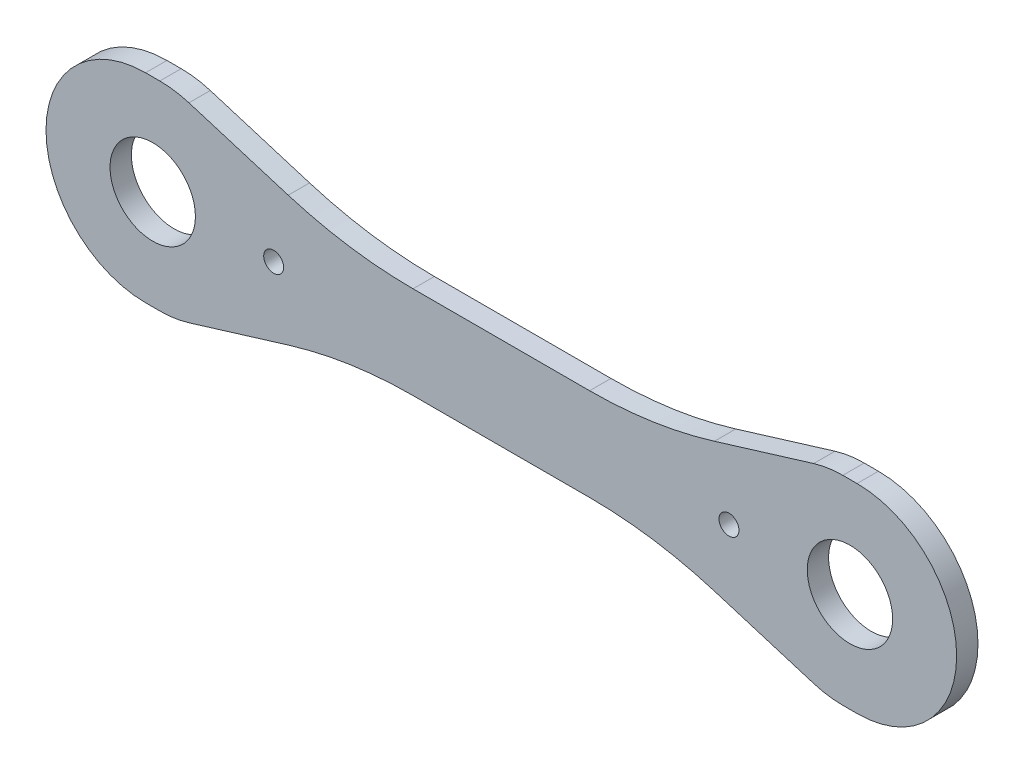
ISO-10303-21;
HEADER;
FILE_DESCRIPTION(('STEP AP214'),'2;1');
FILE_NAME('part.step','',(''),(''),'','','');
FILE_SCHEMA(('AUTOMOTIVE_DESIGN { 1 0 10303 214 1 1 1 1 }'));
ENDSEC;
DATA;
#1=APPLICATION_CONTEXT('core data for automotive mechanical design processes');
#2=APPLICATION_PROTOCOL_DEFINITION('international standard','automotive_design',2000,#1);
#3=PRODUCT_CONTEXT('',#1,'mechanical');
#4=PRODUCT('Part','Part','',(#3));
#5=PRODUCT_RELATED_PRODUCT_CATEGORY('part','',(#4));
#6=PRODUCT_DEFINITION_FORMATION('','',#4);
#7=PRODUCT_DEFINITION_CONTEXT('part definition',#1,'design');
#8=PRODUCT_DEFINITION('design','',#6,#7);
#9=PRODUCT_DEFINITION_SHAPE('','',#8);
#10=(LENGTH_UNIT() NAMED_UNIT(*) SI_UNIT(.MILLI.,.METRE.));
#11=(NAMED_UNIT(*) PLANE_ANGLE_UNIT() SI_UNIT($,.RADIAN.));
#12=(NAMED_UNIT(*) SI_UNIT($,.STERADIAN.) SOLID_ANGLE_UNIT());
#13=UNCERTAINTY_MEASURE_WITH_UNIT(LENGTH_MEASURE(1.E-05),#10,'distance_accuracy_value','');
#14=(GEOMETRIC_REPRESENTATION_CONTEXT(3) GLOBAL_UNCERTAINTY_ASSIGNED_CONTEXT((#13)) GLOBAL_UNIT_ASSIGNED_CONTEXT((#10,
#11,#12)) REPRESENTATION_CONTEXT('',''));
#15=CARTESIAN_POINT('',(0.,0.,0.));
#16=DIRECTION('',(0.,0.,1.));
#17=DIRECTION('',(1.,0.,0.));
#18=AXIS2_PLACEMENT_3D('',#15,#16,#17);
#19=CARTESIAN_POINT('',(-250.,0.,15.));
#20=DIRECTION('',(0.,0.,-1.));
#21=DIRECTION('',(-1.,0.,0.));
#22=AXIS2_PLACEMENT_3D('',#19,#20,#21);
#23=CYLINDRICAL_SURFACE('',#22,70.);
#24=CARTESIAN_POINT('',(-250.,0.,0.));
#25=DIRECTION('',(0.,0.,1.));
#26=DIRECTION('',(1.,0.,0.));
#27=AXIS2_PLACEMENT_3D('',#24,#25,#26);
#28=CIRCLE('',#27,70.);
#29=CARTESIAN_POINT('',(-250.,70.,0.));
#30=VERTEX_POINT('',#29);
#31=CARTESIAN_POINT('',(-250.,-70.,0.));
#32=VERTEX_POINT('',#31);
#33=EDGE_CURVE('E215',#30,#32,#28,.T.);
#34=ORIENTED_EDGE('',*,*,#33,.T.);
#35=DIRECTION('',(0.,0.,-1.));
#36=VECTOR('',#35,1.);
#37=CARTESIAN_POINT('',(-250.,-70.,15.));
#38=LINE('',#37,#36);
#39=CARTESIAN_POINT('',(-250.,-70.,15.));
#40=VERTEX_POINT('',#39);
#41=EDGE_CURVE('E11',#40,#32,#38,.T.);
#42=ORIENTED_EDGE('',*,*,#41,.F.);
#43=CARTESIAN_POINT('',(-250.,0.,15.));
#44=DIRECTION('',(0.,0.,1.));
#45=DIRECTION('',(1.,0.,0.));
#46=AXIS2_PLACEMENT_3D('',#43,#44,#45);
#47=CIRCLE('',#46,70.);
#48=CARTESIAN_POINT('',(-250.,70.,15.));
#49=VERTEX_POINT('',#48);
#50=EDGE_CURVE('E254',#49,#40,#47,.T.);
#51=ORIENTED_EDGE('',*,*,#50,.F.);
#52=DIRECTION('',(0.,0.,-1.));
#53=VECTOR('',#52,1.);
#54=CARTESIAN_POINT('',(-250.,70.,15.));
#55=LINE('',#54,#53);
#56=EDGE_CURVE('E211',#49,#30,#55,.T.);
#57=ORIENTED_EDGE('',*,*,#56,.T.);
#58=EDGE_LOOP('',(#34,#42,#51,#57));
#59=FACE_BOUND('',#58,.T.);
#60=ADVANCED_FACE('F47',(#59),#23,.T.);
#61=CARTESIAN_POINT('',(-250.,-70.,15.));
#62=DIRECTION('',(0.,1.,0.));
#63=DIRECTION('',(0.,0.,1.));
#64=AXIS2_PLACEMENT_3D('',#61,#62,#63);
#65=PLANE('',#64);
#66=DIRECTION('',(1.,0.,0.));
#67=VECTOR('',#66,1.);
#68=CARTESIAN_POINT('',(-250.,-70.,0.));
#69=LINE('',#68,#67);
#70=CARTESIAN_POINT('',(-240.,-70.,0.));
#71=VERTEX_POINT('',#70);
#72=EDGE_CURVE('E218',#32,#71,#69,.T.);
#73=ORIENTED_EDGE('',*,*,#72,.T.);
#74=DIRECTION('',(0.,0.,-1.));
#75=VECTOR('',#74,1.);
#76=CARTESIAN_POINT('',(-240.,-70.,15.));
#77=LINE('',#76,#75);
#78=CARTESIAN_POINT('',(-240.,-70.,15.));
#79=VERTEX_POINT('',#78);
#80=EDGE_CURVE('E55',#79,#71,#77,.T.);
#81=ORIENTED_EDGE('',*,*,#80,.F.);
#82=DIRECTION('',(1.,0.,0.));
#83=VECTOR('',#82,1.);
#84=CARTESIAN_POINT('',(-250.,-70.,15.));
#85=LINE('',#84,#83);
#86=EDGE_CURVE('E142',#40,#79,#85,.T.);
#87=ORIENTED_EDGE('',*,*,#86,.F.);
#88=ORIENTED_EDGE('',*,*,#41,.T.);
#89=EDGE_LOOP('',(#73,#81,#87,#88));
#90=FACE_BOUND('',#89,.T.);
#91=ADVANCED_FACE('F374',(#90),#65,.F.);
#92=CARTESIAN_POINT('',(-240.,0.,15.));
#93=DIRECTION('',(0.,0.,-1.));
#94=DIRECTION('',(-1.,0.,0.));
#95=AXIS2_PLACEMENT_3D('',#92,#93,#94);
#96=CYLINDRICAL_SURFACE('',#95,70.);
#97=CARTESIAN_POINT('',(-240.,0.,0.));
#98=DIRECTION('',(0.,0.,1.));
#99=DIRECTION('',(1.,0.,0.));
#100=AXIS2_PLACEMENT_3D('',#97,#98,#99);
#101=CIRCLE('',#100,70.);
#102=CARTESIAN_POINT('',(-219.533980669408,-66.9413329174125,0.));
#103=VERTEX_POINT('',#102);
#104=EDGE_CURVE('E221',#71,#103,#101,.T.);
#105=ORIENTED_EDGE('',*,*,#104,.T.);
#106=DIRECTION('',(0.,0.,-1.));
#107=VECTOR('',#106,1.);
#108=CARTESIAN_POINT('',(-219.533980669408,-66.9413329174125,15.));
#109=LINE('',#108,#107);
#110=CARTESIAN_POINT('',(-219.533980669408,-66.9413329174125,15.));
#111=VERTEX_POINT('',#110);
#112=EDGE_CURVE('E297',#111,#103,#109,.T.);
#113=ORIENTED_EDGE('',*,*,#112,.F.);
#114=CARTESIAN_POINT('',(-240.,0.,15.));
#115=DIRECTION('',(0.,0.,1.));
#116=DIRECTION('',(1.,0.,0.));
#117=AXIS2_PLACEMENT_3D('',#114,#115,#116);
#118=CIRCLE('',#117,70.);
#119=EDGE_CURVE('E305',#79,#111,#118,.T.);
#120=ORIENTED_EDGE('',*,*,#119,.F.);
#121=ORIENTED_EDGE('',*,*,#80,.T.);
#122=EDGE_LOOP('',(#105,#113,#120,#121));
#123=FACE_BOUND('',#122,.T.);
#124=ADVANCED_FACE('F303',(#123),#96,.T.);
#125=CARTESIAN_POINT('',(-219.533980669408,-66.9413329174125,15.));
#126=DIRECTION('',(-0.292371704722739,0.956304755963035,0.));
#127=DIRECTION('',(-0.956304755963035,-0.292371704722739,0.));
#128=AXIS2_PLACEMENT_3D('',#125,#126,#127);
#129=PLANE('',#128);
#130=DIRECTION('',(0.956304755963035,0.292371704722739,0.));
#131=VECTOR('',#130,1.);
#132=CARTESIAN_POINT('',(-219.533980669408,-66.9413329174125,0.));
#133=LINE('',#132,#131);
#134=CARTESIAN_POINT('',(-149.757667724489,-45.6085732110894,0.));
#135=VERTEX_POINT('',#134);
#136=EDGE_CURVE('E223',#103,#135,#133,.T.);
#137=ORIENTED_EDGE('',*,*,#136,.T.);
#138=DIRECTION('',(0.,0.,-1.));
#139=VECTOR('',#138,1.);
#140=CARTESIAN_POINT('',(-149.757667724489,-45.6085732110894,15.));
#141=LINE('',#140,#139);
#142=CARTESIAN_POINT('',(-149.757667724489,-45.6085732110894,15.));
#143=VERTEX_POINT('',#142);
#144=EDGE_CURVE('E294',#143,#135,#141,.T.);
#145=ORIENTED_EDGE('',*,*,#144,.F.);
#146=DIRECTION('',(0.956304755963035,0.292371704722739,0.));
#147=VECTOR('',#146,1.);
#148=CARTESIAN_POINT('',(-219.533980669408,-66.9413329174125,15.));
#149=LINE('',#148,#147);
#150=EDGE_CURVE('E323',#111,#143,#149,.T.);
#151=ORIENTED_EDGE('',*,*,#150,.F.);
#152=ORIENTED_EDGE('',*,*,#112,.T.);
#153=EDGE_LOOP('',(#137,#145,#151,#152));
#154=FACE_BOUND('',#153,.T.);
#155=ADVANCED_FACE('F314',(#154),#129,.F.);
#156=CARTESIAN_POINT('',(-62.0461563076674,-332.5,15.));
#157=DIRECTION('',(0.,0.,-1.));
#158=DIRECTION('',(-1.,0.,0.));
#159=AXIS2_PLACEMENT_3D('',#156,#157,#158);
#160=CYLINDRICAL_SURFACE('',#159,300.);
#161=CARTESIAN_POINT('',(-62.0461563076674,-332.5,0.));
#162=DIRECTION('',(0.,0.,-1.));
#163=DIRECTION('',(-1.,0.,0.));
#164=AXIS2_PLACEMENT_3D('',#161,#162,#163);
#165=CIRCLE('',#164,300.);
#166=CARTESIAN_POINT('',(-62.0461563076674,-32.5,0.));
#167=VERTEX_POINT('',#166);
#168=EDGE_CURVE('E225',#135,#167,#165,.T.);
#169=ORIENTED_EDGE('',*,*,#168,.T.);
#170=DIRECTION('',(0.,0.,-1.));
#171=VECTOR('',#170,1.);
#172=CARTESIAN_POINT('',(-62.0461563076674,-32.5,15.));
#173=LINE('',#172,#171);
#174=CARTESIAN_POINT('',(-62.0461563076674,-32.5,15.));
#175=VERTEX_POINT('',#174);
#176=EDGE_CURVE('E291',#175,#167,#173,.T.);
#177=ORIENTED_EDGE('',*,*,#176,.F.);
#178=CARTESIAN_POINT('',(-62.0461563076674,-332.5,15.));
#179=DIRECTION('',(0.,0.,-1.));
#180=DIRECTION('',(-1.,0.,0.));
#181=AXIS2_PLACEMENT_3D('',#178,#179,#180);
#182=CIRCLE('',#181,300.);
#183=EDGE_CURVE('E320',#143,#175,#182,.T.);
#184=ORIENTED_EDGE('',*,*,#183,.F.);
#185=ORIENTED_EDGE('',*,*,#144,.T.);
#186=EDGE_LOOP('',(#169,#177,#184,#185));
#187=FACE_BOUND('',#186,.T.);
#188=ADVANCED_FACE('F318',(#187),#160,.F.);
#189=CARTESIAN_POINT('',(-62.0461563076674,-32.5,15.));
#190=DIRECTION('',(0.,1.,0.));
#191=DIRECTION('',(-1.,0.,0.));
#192=AXIS2_PLACEMENT_3D('',#189,#190,#191);
#193=PLANE('',#192);
#194=DIRECTION('',(1.,0.,0.));
#195=VECTOR('',#194,1.);
#196=CARTESIAN_POINT('',(-62.0461563076674,-32.5,0.));
#197=LINE('',#196,#195);
#198=CARTESIAN_POINT('',(62.0461563076675,-32.4999999999999,0.));
#199=VERTEX_POINT('',#198);
#200=EDGE_CURVE('E227',#167,#199,#197,.T.);
#201=ORIENTED_EDGE('',*,*,#200,.T.);
#202=DIRECTION('',(0.,0.,-1.));
#203=VECTOR('',#202,1.);
#204=CARTESIAN_POINT('',(62.0461563076675,-32.4999999999999,15.));
#205=LINE('',#204,#203);
#206=CARTESIAN_POINT('',(62.0461563076675,-32.4999999999999,15.));
#207=VERTEX_POINT('',#206);
#208=EDGE_CURVE('E288',#207,#199,#205,.T.);
#209=ORIENTED_EDGE('',*,*,#208,.F.);
#210=DIRECTION('',(1.,0.,0.));
#211=VECTOR('',#210,1.);
#212=CARTESIAN_POINT('',(-62.0461563076674,-32.5,15.));
#213=LINE('',#212,#211);
#214=EDGE_CURVE('E322',#175,#207,#213,.T.);
#215=ORIENTED_EDGE('',*,*,#214,.F.);
#216=ORIENTED_EDGE('',*,*,#176,.T.);
#217=EDGE_LOOP('',(#201,#209,#215,#216));
#218=FACE_BOUND('',#217,.T.);
#219=ADVANCED_FACE('F387',(#218),#193,.F.);
#220=CARTESIAN_POINT('',(62.0461563076675,-332.5,15.));
#221=DIRECTION('',(0.,0.,-1.));
#222=DIRECTION('',(-1.,0.,0.));
#223=AXIS2_PLACEMENT_3D('',#220,#221,#222);
#224=CYLINDRICAL_SURFACE('',#223,300.);
#225=CARTESIAN_POINT('',(62.0461563076675,-332.5,0.));
#226=DIRECTION('',(0.,0.,-1.));
#227=DIRECTION('',(1.,0.,0.));
#228=AXIS2_PLACEMENT_3D('',#225,#226,#227);
#229=CIRCLE('',#228,300.);
#230=CARTESIAN_POINT('',(149.757667724489,-45.6085732110892,0.));
#231=VERTEX_POINT('',#230);
#232=EDGE_CURVE('E229',#199,#231,#229,.T.);
#233=ORIENTED_EDGE('',*,*,#232,.T.);
#234=DIRECTION('',(0.,0.,-1.));
#235=VECTOR('',#234,1.);
#236=CARTESIAN_POINT('',(149.757667724489,-45.6085732110892,15.));
#237=LINE('',#236,#235);
#238=CARTESIAN_POINT('',(149.757667724489,-45.6085732110892,15.));
#239=VERTEX_POINT('',#238);
#240=EDGE_CURVE('E285',#239,#231,#237,.T.);
#241=ORIENTED_EDGE('',*,*,#240,.F.);
#242=CARTESIAN_POINT('',(62.0461563076675,-332.5,15.));
#243=DIRECTION('',(0.,0.,-1.));
#244=DIRECTION('',(1.,0.,0.));
#245=AXIS2_PLACEMENT_3D('',#242,#243,#244);
#246=CIRCLE('',#245,300.);
#247=EDGE_CURVE('E325',#207,#239,#246,.T.);
#248=ORIENTED_EDGE('',*,*,#247,.F.);
#249=ORIENTED_EDGE('',*,*,#208,.T.);
#250=EDGE_LOOP('',(#233,#241,#248,#249));
#251=FACE_BOUND('',#250,.T.);
#252=ADVANCED_FACE('F390',(#251),#224,.F.);
#253=CARTESIAN_POINT('',(219.533980669408,-66.9413329174124,15.));
#254=DIRECTION('',(0.292371704722739,0.956304755963035,0.));
#255=DIRECTION('',(-0.956304755963035,0.292371704722739,0.));
#256=AXIS2_PLACEMENT_3D('',#253,#254,#255);
#257=PLANE('',#256);
#258=DIRECTION('',(0.956304755963035,-0.292371704722739,0.));
#259=VECTOR('',#258,1.);
#260=CARTESIAN_POINT('',(219.533980669408,-66.9413329174124,0.));
#261=LINE('',#260,#259);
#262=CARTESIAN_POINT('',(219.533980669408,-66.9413329174124,0.));
#263=VERTEX_POINT('',#262);
#264=EDGE_CURVE('E231',#231,#263,#261,.T.);
#265=ORIENTED_EDGE('',*,*,#264,.T.);
#266=DIRECTION('',(0.,0.,-1.));
#267=VECTOR('',#266,1.);
#268=CARTESIAN_POINT('',(219.533980669408,-66.9413329174124,15.));
#269=LINE('',#268,#267);
#270=CARTESIAN_POINT('',(219.533980669408,-66.9413329174124,15.));
#271=VERTEX_POINT('',#270);
#272=EDGE_CURVE('E282',#271,#263,#269,.T.);
#273=ORIENTED_EDGE('',*,*,#272,.F.);
#274=DIRECTION('',(0.956304755963035,-0.292371704722739,0.));
#275=VECTOR('',#274,1.);
#276=CARTESIAN_POINT('',(219.533980669408,-66.9413329174124,15.));
#277=LINE('',#276,#275);
#278=EDGE_CURVE('E331',#239,#271,#277,.T.);
#279=ORIENTED_EDGE('',*,*,#278,.F.);
#280=ORIENTED_EDGE('',*,*,#240,.T.);
#281=EDGE_LOOP('',(#265,#273,#279,#280));
#282=FACE_BOUND('',#281,.T.);
#283=ADVANCED_FACE('F394',(#282),#257,.F.);
#284=CARTESIAN_POINT('',(240.,0.,15.));
#285=DIRECTION('',(0.,0.,-1.));
#286=DIRECTION('',(-1.,0.,0.));
#287=AXIS2_PLACEMENT_3D('',#284,#285,#286);
#288=CYLINDRICAL_SURFACE('',#287,69.9999999999999);
#289=CARTESIAN_POINT('',(240.,0.,0.));
#290=DIRECTION('',(0.,0.,1.));
#291=DIRECTION('',(-1.,0.,0.));
#292=AXIS2_PLACEMENT_3D('',#289,#290,#291);
#293=CIRCLE('',#292,69.9999999999999);
#294=CARTESIAN_POINT('',(240.,-69.9999999999999,0.));
#295=VERTEX_POINT('',#294);
#296=EDGE_CURVE('E233',#263,#295,#293,.T.);
#297=ORIENTED_EDGE('',*,*,#296,.T.);
#298=DIRECTION('',(0.,0.,-1.));
#299=VECTOR('',#298,1.);
#300=CARTESIAN_POINT('',(240.,-69.9999999999999,15.));
#301=LINE('',#300,#299);
#302=CARTESIAN_POINT('',(240.,-69.9999999999999,15.));
#303=VERTEX_POINT('',#302);
#304=EDGE_CURVE('E279',#303,#295,#301,.T.);
#305=ORIENTED_EDGE('',*,*,#304,.F.);
#306=CARTESIAN_POINT('',(240.,0.,15.));
#307=DIRECTION('',(0.,0.,1.));
#308=DIRECTION('',(-1.,0.,0.));
#309=AXIS2_PLACEMENT_3D('',#306,#307,#308);
#310=CIRCLE('',#309,69.9999999999999);
#311=EDGE_CURVE('E333',#271,#303,#310,.T.);
#312=ORIENTED_EDGE('',*,*,#311,.F.);
#313=ORIENTED_EDGE('',*,*,#272,.T.);
#314=EDGE_LOOP('',(#297,#305,#312,#313));
#315=FACE_BOUND('',#314,.T.);
#316=ADVANCED_FACE('F398',(#315),#288,.T.);
#317=CARTESIAN_POINT('',(250.,-69.9999999999999,15.));
#318=DIRECTION('',(0.,1.,0.));
#319=DIRECTION('',(0.,0.,1.));
#320=AXIS2_PLACEMENT_3D('',#317,#318,#319);
#321=PLANE('',#320);
#322=DIRECTION('',(1.,0.,0.));
#323=VECTOR('',#322,1.);
#324=CARTESIAN_POINT('',(250.,-69.9999999999999,0.));
#325=LINE('',#324,#323);
#326=CARTESIAN_POINT('',(250.,-70.,0.));
#327=VERTEX_POINT('',#326);
#328=EDGE_CURVE('E235',#295,#327,#325,.T.);
#329=ORIENTED_EDGE('',*,*,#328,.T.);
#330=DIRECTION('',(0.,0.,-1.));
#331=VECTOR('',#330,1.);
#332=CARTESIAN_POINT('',(250.,-70.,15.));
#333=LINE('',#332,#331);
#334=CARTESIAN_POINT('',(250.,-70.,15.));
#335=VERTEX_POINT('',#334);
#336=EDGE_CURVE('E276',#335,#327,#333,.T.);
#337=ORIENTED_EDGE('',*,*,#336,.F.);
#338=DIRECTION('',(1.,0.,0.));
#339=VECTOR('',#338,1.);
#340=CARTESIAN_POINT('',(250.,-69.9999999999999,15.));
#341=LINE('',#340,#339);
#342=EDGE_CURVE('E335',#303,#335,#341,.T.);
#343=ORIENTED_EDGE('',*,*,#342,.F.);
#344=ORIENTED_EDGE('',*,*,#304,.T.);
#345=EDGE_LOOP('',(#329,#337,#343,#344));
#346=FACE_BOUND('',#345,.T.);
#347=ADVANCED_FACE('F402',(#346),#321,.F.);
#348=CARTESIAN_POINT('',(250.,0.,15.));
#349=DIRECTION('',(0.,0.,-1.));
#350=DIRECTION('',(-1.,0.,0.));
#351=AXIS2_PLACEMENT_3D('',#348,#349,#350);
#352=CYLINDRICAL_SURFACE('',#351,70.);
#353=CARTESIAN_POINT('',(250.,0.,0.));
#354=DIRECTION('',(0.,0.,1.));
#355=DIRECTION('',(-1.,0.,0.));
#356=AXIS2_PLACEMENT_3D('',#353,#354,#355);
#357=CIRCLE('',#356,70.);
#358=CARTESIAN_POINT('',(250.,70.,0.));
#359=VERTEX_POINT('',#358);
#360=EDGE_CURVE('E237',#327,#359,#357,.T.);
#361=ORIENTED_EDGE('',*,*,#360,.T.);
#362=DIRECTION('',(0.,0.,-1.));
#363=VECTOR('',#362,1.);
#364=CARTESIAN_POINT('',(250.,70.,15.));
#365=LINE('',#364,#363);
#366=CARTESIAN_POINT('',(250.,70.,15.));
#367=VERTEX_POINT('',#366);
#368=EDGE_CURVE('E273',#367,#359,#365,.T.);
#369=ORIENTED_EDGE('',*,*,#368,.F.);
#370=CARTESIAN_POINT('',(250.,0.,15.));
#371=DIRECTION('',(0.,0.,1.));
#372=DIRECTION('',(-1.,0.,0.));
#373=AXIS2_PLACEMENT_3D('',#370,#371,#372);
#374=CIRCLE('',#373,70.);
#375=EDGE_CURVE('E337',#335,#367,#374,.T.);
#376=ORIENTED_EDGE('',*,*,#375,.F.);
#377=ORIENTED_EDGE('',*,*,#336,.T.);
#378=EDGE_LOOP('',(#361,#369,#376,#377));
#379=FACE_BOUND('',#378,.T.);
#380=ADVANCED_FACE('F406',(#379),#352,.T.);
#381=CARTESIAN_POINT('',(250.,70.,15.));
#382=DIRECTION('',(0.,-1.,0.));
#383=DIRECTION('',(0.,0.,-1.));
#384=AXIS2_PLACEMENT_3D('',#381,#382,#383);
#385=PLANE('',#384);
#386=DIRECTION('',(-1.,0.,0.));
#387=VECTOR('',#386,1.);
#388=CARTESIAN_POINT('',(250.,70.,0.));
#389=LINE('',#388,#387);
#390=CARTESIAN_POINT('',(240.,70.,0.));
#391=VERTEX_POINT('',#390);
#392=EDGE_CURVE('E239',#359,#391,#389,.T.);
#393=ORIENTED_EDGE('',*,*,#392,.T.);
#394=DIRECTION('',(0.,0.,-1.));
#395=VECTOR('',#394,1.);
#396=CARTESIAN_POINT('',(240.,70.,15.));
#397=LINE('',#396,#395);
#398=CARTESIAN_POINT('',(240.,70.,15.));
#399=VERTEX_POINT('',#398);
#400=EDGE_CURVE('E270',#399,#391,#397,.T.);
#401=ORIENTED_EDGE('',*,*,#400,.F.);
#402=DIRECTION('',(-1.,0.,0.));
#403=VECTOR('',#402,1.);
#404=CARTESIAN_POINT('',(250.,70.,15.));
#405=LINE('',#404,#403);
#406=EDGE_CURVE('E339',#367,#399,#405,.T.);
#407=ORIENTED_EDGE('',*,*,#406,.F.);
#408=ORIENTED_EDGE('',*,*,#368,.T.);
#409=EDGE_LOOP('',(#393,#401,#407,#408));
#410=FACE_BOUND('',#409,.T.);
#411=ADVANCED_FACE('F410',(#410),#385,.F.);
#412=CARTESIAN_POINT('',(240.,0.,15.));
#413=DIRECTION('',(0.,0.,-1.));
#414=DIRECTION('',(-1.,0.,0.));
#415=AXIS2_PLACEMENT_3D('',#412,#413,#414);
#416=CYLINDRICAL_SURFACE('',#415,70.);
#417=CARTESIAN_POINT('',(240.,0.,0.));
#418=DIRECTION('',(0.,0.,1.));
#419=DIRECTION('',(1.,0.,0.));
#420=AXIS2_PLACEMENT_3D('',#417,#418,#419);
#421=CIRCLE('',#420,70.);
#422=CARTESIAN_POINT('',(219.533980669408,66.9413329174125,0.));
#423=VERTEX_POINT('',#422);
#424=EDGE_CURVE('E241',#391,#423,#421,.T.);
#425=ORIENTED_EDGE('',*,*,#424,.T.);
#426=DIRECTION('',(0.,0.,-1.));
#427=VECTOR('',#426,1.);
#428=CARTESIAN_POINT('',(219.533980669408,66.9413329174125,15.));
#429=LINE('',#428,#427);
#430=CARTESIAN_POINT('',(219.533980669408,66.9413329174125,15.));
#431=VERTEX_POINT('',#430);
#432=EDGE_CURVE('E267',#431,#423,#429,.T.);
#433=ORIENTED_EDGE('',*,*,#432,.F.);
#434=CARTESIAN_POINT('',(240.,0.,15.));
#435=DIRECTION('',(0.,0.,1.));
#436=DIRECTION('',(1.,0.,0.));
#437=AXIS2_PLACEMENT_3D('',#434,#435,#436);
#438=CIRCLE('',#437,70.);
#439=EDGE_CURVE('E341',#399,#431,#438,.T.);
#440=ORIENTED_EDGE('',*,*,#439,.F.);
#441=ORIENTED_EDGE('',*,*,#400,.T.);
#442=EDGE_LOOP('',(#425,#433,#440,#441));
#443=FACE_BOUND('',#442,.T.);
#444=ADVANCED_FACE('F414',(#443),#416,.T.);
#445=CARTESIAN_POINT('',(219.533980669408,66.9413329174125,15.));
#446=DIRECTION('',(0.292371704722739,-0.956304755963035,0.));
#447=DIRECTION('',(0.956304755963035,0.292371704722739,0.));
#448=AXIS2_PLACEMENT_3D('',#445,#446,#447);
#449=PLANE('',#448);
#450=DIRECTION('',(-0.956304755963035,-0.292371704722739,0.));
#451=VECTOR('',#450,1.);
#452=CARTESIAN_POINT('',(219.533980669408,66.9413329174125,0.));
#453=LINE('',#452,#451);
#454=CARTESIAN_POINT('',(149.757667724489,45.6085732110894,0.));
#455=VERTEX_POINT('',#454);
#456=EDGE_CURVE('E243',#423,#455,#453,.T.);
#457=ORIENTED_EDGE('',*,*,#456,.T.);
#458=DIRECTION('',(0.,0.,-1.));
#459=VECTOR('',#458,1.);
#460=CARTESIAN_POINT('',(149.757667724489,45.6085732110894,15.));
#461=LINE('',#460,#459);
#462=CARTESIAN_POINT('',(149.757667724489,45.6085732110894,15.));
#463=VERTEX_POINT('',#462);
#464=EDGE_CURVE('E264',#463,#455,#461,.T.);
#465=ORIENTED_EDGE('',*,*,#464,.F.);
#466=DIRECTION('',(-0.956304755963035,-0.292371704722739,0.));
#467=VECTOR('',#466,1.);
#468=CARTESIAN_POINT('',(219.533980669408,66.9413329174125,15.));
#469=LINE('',#468,#467);
#470=EDGE_CURVE('E343',#431,#463,#469,.T.);
#471=ORIENTED_EDGE('',*,*,#470,.F.);
#472=ORIENTED_EDGE('',*,*,#432,.T.);
#473=EDGE_LOOP('',(#457,#465,#471,#472));
#474=FACE_BOUND('',#473,.T.);
#475=ADVANCED_FACE('F418',(#474),#449,.F.);
#476=CARTESIAN_POINT('',(62.0461563076675,332.5,15.));
#477=DIRECTION('',(0.,0.,-1.));
#478=DIRECTION('',(-1.,0.,0.));
#479=AXIS2_PLACEMENT_3D('',#476,#477,#478);
#480=CYLINDRICAL_SURFACE('',#479,300.);
#481=CARTESIAN_POINT('',(62.0461563076675,332.5,0.));
#482=DIRECTION('',(0.,0.,-1.));
#483=DIRECTION('',(-1.,0.,0.));
#484=AXIS2_PLACEMENT_3D('',#481,#482,#483);
#485=CIRCLE('',#484,300.);
#486=CARTESIAN_POINT('',(62.0461563076675,32.5,0.));
#487=VERTEX_POINT('',#486);
#488=EDGE_CURVE('E245',#455,#487,#485,.T.);
#489=ORIENTED_EDGE('',*,*,#488,.T.);
#490=DIRECTION('',(0.,0.,-1.));
#491=VECTOR('',#490,1.);
#492=CARTESIAN_POINT('',(62.0461563076675,32.5,15.));
#493=LINE('',#492,#491);
#494=CARTESIAN_POINT('',(62.0461563076675,32.5,15.));
#495=VERTEX_POINT('',#494);
#496=EDGE_CURVE('E261',#495,#487,#493,.T.);
#497=ORIENTED_EDGE('',*,*,#496,.F.);
#498=CARTESIAN_POINT('',(62.0461563076675,332.5,15.));
#499=DIRECTION('',(0.,0.,-1.));
#500=DIRECTION('',(-1.,0.,0.));
#501=AXIS2_PLACEMENT_3D('',#498,#499,#500);
#502=CIRCLE('',#501,300.);
#503=EDGE_CURVE('E345',#463,#495,#502,.T.);
#504=ORIENTED_EDGE('',*,*,#503,.F.);
#505=ORIENTED_EDGE('',*,*,#464,.T.);
#506=EDGE_LOOP('',(#489,#497,#504,#505));
#507=FACE_BOUND('',#506,.T.);
#508=ADVANCED_FACE('F422',(#507),#480,.F.);
#509=CARTESIAN_POINT('',(-62.0461563076674,32.5,15.));
#510=DIRECTION('',(0.,-1.,0.));
#511=DIRECTION('',(0.,0.,-1.));
#512=AXIS2_PLACEMENT_3D('',#509,#510,#511);
#513=PLANE('',#512);
#514=DIRECTION('',(-1.,0.,0.));
#515=VECTOR('',#514,1.);
#516=CARTESIAN_POINT('',(-62.0461563076674,32.5,0.));
#517=LINE('',#516,#515);
#518=CARTESIAN_POINT('',(-62.0461563076675,32.4999999999999,0.));
#519=VERTEX_POINT('',#518);
#520=EDGE_CURVE('E247',#487,#519,#517,.T.);
#521=ORIENTED_EDGE('',*,*,#520,.T.);
#522=DIRECTION('',(0.,0.,-1.));
#523=VECTOR('',#522,1.);
#524=CARTESIAN_POINT('',(-62.0461563076675,32.4999999999999,15.));
#525=LINE('',#524,#523);
#526=CARTESIAN_POINT('',(-62.0461563076675,32.4999999999999,15.));
#527=VERTEX_POINT('',#526);
#528=EDGE_CURVE('E258',#527,#519,#525,.T.);
#529=ORIENTED_EDGE('',*,*,#528,.F.);
#530=DIRECTION('',(-1.,0.,0.));
#531=VECTOR('',#530,1.);
#532=CARTESIAN_POINT('',(-62.0461563076674,32.5,15.));
#533=LINE('',#532,#531);
#534=EDGE_CURVE('E347',#495,#527,#533,.T.);
#535=ORIENTED_EDGE('',*,*,#534,.F.);
#536=ORIENTED_EDGE('',*,*,#496,.T.);
#537=EDGE_LOOP('',(#521,#529,#535,#536));
#538=FACE_BOUND('',#537,.T.);
#539=ADVANCED_FACE('F353',(#538),#513,.F.);
#540=CARTESIAN_POINT('',(-62.0461563076675,332.5,15.));
#541=DIRECTION('',(0.,0.,-1.));
#542=DIRECTION('',(-1.,0.,0.));
#543=AXIS2_PLACEMENT_3D('',#540,#541,#542);
#544=CYLINDRICAL_SURFACE('',#543,300.);
#545=CARTESIAN_POINT('',(-62.0461563076675,332.5,0.));
#546=DIRECTION('',(0.,0.,-1.));
#547=DIRECTION('',(1.,0.,0.));
#548=AXIS2_PLACEMENT_3D('',#545,#546,#547);
#549=CIRCLE('',#548,300.);
#550=CARTESIAN_POINT('',(-149.757667724489,45.6085732110893,0.));
#551=VERTEX_POINT('',#550);
#552=EDGE_CURVE('E249',#519,#551,#549,.T.);
#553=ORIENTED_EDGE('',*,*,#552,.T.);
#554=DIRECTION('',(0.,0.,-1.));
#555=VECTOR('',#554,1.);
#556=CARTESIAN_POINT('',(-149.757667724489,45.6085732110893,15.));
#557=LINE('',#556,#555);
#558=CARTESIAN_POINT('',(-149.757667724489,45.6085732110893,15.));
#559=VERTEX_POINT('',#558);
#560=EDGE_CURVE('E206',#559,#551,#557,.T.);
#561=ORIENTED_EDGE('',*,*,#560,.F.);
#562=CARTESIAN_POINT('',(-62.0461563076675,332.5,15.));
#563=DIRECTION('',(0.,0.,-1.));
#564=DIRECTION('',(1.,0.,0.));
#565=AXIS2_PLACEMENT_3D('',#562,#563,#564);
#566=CIRCLE('',#565,300.);
#567=EDGE_CURVE('E197',#527,#559,#566,.T.);
#568=ORIENTED_EDGE('',*,*,#567,.F.);
#569=ORIENTED_EDGE('',*,*,#528,.T.);
#570=EDGE_LOOP('',(#553,#561,#568,#569));
#571=FACE_BOUND('',#570,.T.);
#572=ADVANCED_FACE('F357',(#571),#544,.F.);
#573=CARTESIAN_POINT('',(-219.533980669408,66.9413329174125,15.));
#574=DIRECTION('',(-0.292371704722738,-0.956304755963035,0.));
#575=DIRECTION('',(0.956304755963035,-0.292371704722738,0.));
#576=AXIS2_PLACEMENT_3D('',#573,#574,#575);
#577=PLANE('',#576);
#578=DIRECTION('',(-0.956304755963035,0.292371704722738,0.));
#579=VECTOR('',#578,1.);
#580=CARTESIAN_POINT('',(-219.533980669408,66.9413329174125,0.));
#581=LINE('',#580,#579);
#582=CARTESIAN_POINT('',(-219.533980669408,66.9413329174124,0.));
#583=VERTEX_POINT('',#582);
#584=EDGE_CURVE('E205',#551,#583,#581,.T.);
#585=ORIENTED_EDGE('',*,*,#584,.T.);
#586=DIRECTION('',(0.,0.,-1.));
#587=VECTOR('',#586,1.);
#588=CARTESIAN_POINT('',(-219.533980669408,66.9413329174124,15.));
#589=LINE('',#588,#587);
#590=CARTESIAN_POINT('',(-219.533980669408,66.9413329174124,15.));
#591=VERTEX_POINT('',#590);
#592=EDGE_CURVE('E202',#591,#583,#589,.T.);
#593=ORIENTED_EDGE('',*,*,#592,.F.);
#594=DIRECTION('',(-0.956304755963035,0.292371704722738,0.));
#595=VECTOR('',#594,1.);
#596=CARTESIAN_POINT('',(-219.533980669408,66.9413329174125,15.));
#597=LINE('',#596,#595);
#598=EDGE_CURVE('E191',#559,#591,#597,.T.);
#599=ORIENTED_EDGE('',*,*,#598,.F.);
#600=ORIENTED_EDGE('',*,*,#560,.T.);
#601=EDGE_LOOP('',(#585,#593,#599,#600));
#602=FACE_BOUND('',#601,.T.);
#603=ADVANCED_FACE('F203',(#602),#577,.F.);
#604=CARTESIAN_POINT('',(-240.,0.,15.));
#605=DIRECTION('',(0.,0.,-1.));
#606=DIRECTION('',(-1.,0.,0.));
#607=AXIS2_PLACEMENT_3D('',#604,#605,#606);
#608=CYLINDRICAL_SURFACE('',#607,70.);
#609=CARTESIAN_POINT('',(-240.,0.,0.));
#610=DIRECTION('',(0.,0.,1.));
#611=DIRECTION('',(-1.,0.,0.));
#612=AXIS2_PLACEMENT_3D('',#609,#610,#611);
#613=CIRCLE('',#612,70.);
#614=CARTESIAN_POINT('',(-240.,70.,0.));
#615=VERTEX_POINT('',#614);
#616=EDGE_CURVE('E128',#583,#615,#613,.T.);
#617=ORIENTED_EDGE('',*,*,#616,.T.);
#618=DIRECTION('',(0.,0.,-1.));
#619=VECTOR('',#618,1.);
#620=CARTESIAN_POINT('',(-240.,70.,15.));
#621=LINE('',#620,#619);
#622=CARTESIAN_POINT('',(-240.,70.,15.));
#623=VERTEX_POINT('',#622);
#624=EDGE_CURVE('E207',#623,#615,#621,.T.);
#625=ORIENTED_EDGE('',*,*,#624,.F.);
#626=CARTESIAN_POINT('',(-240.,0.,15.));
#627=DIRECTION('',(0.,0.,1.));
#628=DIRECTION('',(-1.,0.,0.));
#629=AXIS2_PLACEMENT_3D('',#626,#627,#628);
#630=CIRCLE('',#629,70.);
#631=EDGE_CURVE('E195',#591,#623,#630,.T.);
#632=ORIENTED_EDGE('',*,*,#631,.F.);
#633=ORIENTED_EDGE('',*,*,#592,.T.);
#634=EDGE_LOOP('',(#617,#625,#632,#633));
#635=FACE_BOUND('',#634,.T.);
#636=ADVANCED_FACE('F209',(#635),#608,.T.);
#637=CARTESIAN_POINT('',(-250.,70.,15.));
#638=DIRECTION('',(0.,-1.,0.));
#639=DIRECTION('',(0.,0.,-1.));
#640=AXIS2_PLACEMENT_3D('',#637,#638,#639);
#641=PLANE('',#640);
#642=DIRECTION('',(-1.,0.,0.));
#643=VECTOR('',#642,1.);
#644=CARTESIAN_POINT('',(-250.,70.,0.));
#645=LINE('',#644,#643);
#646=EDGE_CURVE('E134',#615,#30,#645,.T.);
#647=ORIENTED_EDGE('',*,*,#646,.T.);
#648=ORIENTED_EDGE('',*,*,#56,.F.);
#649=DIRECTION('',(-1.,0.,0.));
#650=VECTOR('',#649,1.);
#651=CARTESIAN_POINT('',(-250.,70.,15.));
#652=LINE('',#651,#650);
#653=EDGE_CURVE('E63',#623,#49,#652,.T.);
#654=ORIENTED_EDGE('',*,*,#653,.F.);
#655=ORIENTED_EDGE('',*,*,#624,.T.);
#656=EDGE_LOOP('',(#647,#648,#654,#655));
#657=FACE_BOUND('',#656,.T.);
#658=ADVANCED_FACE('F361',(#657),#641,.F.);
#659=CARTESIAN_POINT('',(-250.,0.,15.));
#660=DIRECTION('',(0.,0.,1.));
#661=DIRECTION('',(1.,0.,0.));
#662=AXIS2_PLACEMENT_3D('',#659,#660,#661);
#663=PLANE('',#662);
#664=CARTESIAN_POINT('',(-160.,0.,15.));
#665=DIRECTION('',(0.,0.,1.));
#666=DIRECTION('',(1.,0.,0.));
#667=AXIS2_PLACEMENT_3D('',#664,#665,#666);
#668=CIRCLE('',#667,7.00000000000001);
#669=CARTESIAN_POINT('',(-153.,0.,15.));
#670=VERTEX_POINT('',#669);
#671=EDGE_CURVE('E503',#670,#670,#668,.T.);
#672=ORIENTED_EDGE('',*,*,#671,.F.);
#673=EDGE_LOOP('',(#672));
#674=FACE_BOUND('',#673,.T.);
#675=CARTESIAN_POINT('',(160.,0.,15.));
#676=DIRECTION('',(0.,0.,1.));
#677=DIRECTION('',(1.,0.,0.));
#678=AXIS2_PLACEMENT_3D('',#675,#676,#677);
#679=CIRCLE('',#678,7.00000000000001);
#680=CARTESIAN_POINT('',(167.,0.,15.));
#681=VERTEX_POINT('',#680);
#682=EDGE_CURVE('E505',#681,#681,#679,.T.);
#683=ORIENTED_EDGE('',*,*,#682,.F.);
#684=EDGE_LOOP('',(#683));
#685=FACE_BOUND('',#684,.T.);
#686=CARTESIAN_POINT('',(-245.,0.,15.));
#687=DIRECTION('',(0.,0.,1.));
#688=DIRECTION('',(1.,0.,0.));
#689=AXIS2_PLACEMENT_3D('',#686,#687,#688);
#690=CIRCLE('',#689,30.);
#691=CARTESIAN_POINT('',(-215.,0.,15.));
#692=VERTEX_POINT('',#691);
#693=EDGE_CURVE('E511',#692,#692,#690,.T.);
#694=ORIENTED_EDGE('',*,*,#693,.F.);
#695=EDGE_LOOP('',(#694));
#696=FACE_BOUND('',#695,.T.);
#697=CARTESIAN_POINT('',(245.,0.,15.));
#698=DIRECTION('',(0.,0.,1.));
#699=DIRECTION('',(1.,0.,0.));
#700=AXIS2_PLACEMENT_3D('',#697,#698,#699);
#701=CIRCLE('',#700,30.0000000000001);
#702=CARTESIAN_POINT('',(275.,0.,15.));
#703=VERTEX_POINT('',#702);
#704=EDGE_CURVE('E517',#703,#703,#701,.T.);
#705=ORIENTED_EDGE('',*,*,#704,.F.);
#706=EDGE_LOOP('',(#705));
#707=FACE_BOUND('',#706,.T.);
#708=ORIENTED_EDGE('',*,*,#50,.T.);
#709=ORIENTED_EDGE('',*,*,#86,.T.);
#710=ORIENTED_EDGE('',*,*,#119,.T.);
#711=ORIENTED_EDGE('',*,*,#150,.T.);
#712=ORIENTED_EDGE('',*,*,#183,.T.);
#713=ORIENTED_EDGE('',*,*,#214,.T.);
#714=ORIENTED_EDGE('',*,*,#247,.T.);
#715=ORIENTED_EDGE('',*,*,#278,.T.);
#716=ORIENTED_EDGE('',*,*,#311,.T.);
#717=ORIENTED_EDGE('',*,*,#342,.T.);
#718=ORIENTED_EDGE('',*,*,#375,.T.);
#719=ORIENTED_EDGE('',*,*,#406,.T.);
#720=ORIENTED_EDGE('',*,*,#439,.T.);
#721=ORIENTED_EDGE('',*,*,#470,.T.);
#722=ORIENTED_EDGE('',*,*,#503,.T.);
#723=ORIENTED_EDGE('',*,*,#534,.T.);
#724=ORIENTED_EDGE('',*,*,#567,.T.);
#725=ORIENTED_EDGE('',*,*,#598,.T.);
#726=ORIENTED_EDGE('',*,*,#631,.T.);
#727=ORIENTED_EDGE('',*,*,#653,.T.);
#728=EDGE_LOOP('',(#708,#709,#710,#711,#712,#713,#714,#715,#716,#717,#718,#719,#720,#721,#722,
#723,#724,#725,#726,#727));
#729=FACE_BOUND('',#728,.T.);
#730=ADVANCED_FACE('F193',(#674,#685,#696,#707,#729),#663,.T.);
#731=CARTESIAN_POINT('',(-250.,0.,0.));
#732=DIRECTION('',(0.,0.,1.));
#733=DIRECTION('',(1.,0.,0.));
#734=AXIS2_PLACEMENT_3D('',#731,#732,#733);
#735=PLANE('',#734);
#736=CARTESIAN_POINT('',(-160.,0.,0.));
#737=DIRECTION('',(0.,0.,1.));
#738=DIRECTION('',(1.,0.,0.));
#739=AXIS2_PLACEMENT_3D('',#736,#737,#738);
#740=CIRCLE('',#739,7.00000000000001);
#741=CARTESIAN_POINT('',(-153.,0.,0.));
#742=VERTEX_POINT('',#741);
#743=EDGE_CURVE('E500',#742,#742,#740,.T.);
#744=ORIENTED_EDGE('',*,*,#743,.T.);
#745=EDGE_LOOP('',(#744));
#746=FACE_BOUND('',#745,.T.);
#747=CARTESIAN_POINT('',(160.,0.,0.));
#748=DIRECTION('',(0.,0.,1.));
#749=DIRECTION('',(1.,0.,0.));
#750=AXIS2_PLACEMENT_3D('',#747,#748,#749);
#751=CIRCLE('',#750,7.00000000000001);
#752=CARTESIAN_POINT('',(167.,0.,0.));
#753=VERTEX_POINT('',#752);
#754=EDGE_CURVE('E508',#753,#753,#751,.T.);
#755=ORIENTED_EDGE('',*,*,#754,.T.);
#756=EDGE_LOOP('',(#755));
#757=FACE_BOUND('',#756,.T.);
#758=CARTESIAN_POINT('',(-245.,0.,0.));
#759=DIRECTION('',(0.,0.,1.));
#760=DIRECTION('',(1.,0.,0.));
#761=AXIS2_PLACEMENT_3D('',#758,#759,#760);
#762=CIRCLE('',#761,30.);
#763=CARTESIAN_POINT('',(-215.,0.,0.));
#764=VERTEX_POINT('',#763);
#765=EDGE_CURVE('E514',#764,#764,#762,.T.);
#766=ORIENTED_EDGE('',*,*,#765,.T.);
#767=EDGE_LOOP('',(#766));
#768=FACE_BOUND('',#767,.T.);
#769=CARTESIAN_POINT('',(245.,0.,0.));
#770=DIRECTION('',(0.,0.,1.));
#771=DIRECTION('',(1.,0.,0.));
#772=AXIS2_PLACEMENT_3D('',#769,#770,#771);
#773=CIRCLE('',#772,30.0000000000001);
#774=CARTESIAN_POINT('',(275.,0.,0.));
#775=VERTEX_POINT('',#774);
#776=EDGE_CURVE('E219',#775,#775,#773,.T.);
#777=ORIENTED_EDGE('',*,*,#776,.T.);
#778=EDGE_LOOP('',(#777));
#779=FACE_BOUND('',#778,.T.);
#780=ORIENTED_EDGE('',*,*,#33,.F.);
#781=ORIENTED_EDGE('',*,*,#646,.F.);
#782=ORIENTED_EDGE('',*,*,#616,.F.);
#783=ORIENTED_EDGE('',*,*,#584,.F.);
#784=ORIENTED_EDGE('',*,*,#552,.F.);
#785=ORIENTED_EDGE('',*,*,#520,.F.);
#786=ORIENTED_EDGE('',*,*,#488,.F.);
#787=ORIENTED_EDGE('',*,*,#456,.F.);
#788=ORIENTED_EDGE('',*,*,#424,.F.);
#789=ORIENTED_EDGE('',*,*,#392,.F.);
#790=ORIENTED_EDGE('',*,*,#360,.F.);
#791=ORIENTED_EDGE('',*,*,#328,.F.);
#792=ORIENTED_EDGE('',*,*,#296,.F.);
#793=ORIENTED_EDGE('',*,*,#264,.F.);
#794=ORIENTED_EDGE('',*,*,#232,.F.);
#795=ORIENTED_EDGE('',*,*,#200,.F.);
#796=ORIENTED_EDGE('',*,*,#168,.F.);
#797=ORIENTED_EDGE('',*,*,#136,.F.);
#798=ORIENTED_EDGE('',*,*,#104,.F.);
#799=ORIENTED_EDGE('',*,*,#72,.F.);
#800=EDGE_LOOP('',(#780,#781,#782,#783,#784,#785,#786,#787,#788,#789,#790,#791,#792,#793,#794,
#795,#796,#797,#798,#799));
#801=FACE_BOUND('',#800,.T.);
#802=ADVANCED_FACE('F309',(#746,#757,#768,#779,#801),#735,.F.);
#803=CARTESIAN_POINT('',(245.,0.,0.));
#804=DIRECTION('',(0.,0.,1.));
#805=DIRECTION('',(1.,0.,0.));
#806=AXIS2_PLACEMENT_3D('',#803,#804,#805);
#807=CYLINDRICAL_SURFACE('',#806,30.0000000000001);
#808=ORIENTED_EDGE('',*,*,#776,.F.);
#809=EDGE_LOOP('',(#808));
#810=FACE_BOUND('',#809,.T.);
#811=ORIENTED_EDGE('',*,*,#704,.T.);
#812=EDGE_LOOP('',(#811));
#813=FACE_BOUND('',#812,.T.);
#814=ADVANCED_FACE('F454',(#810,#813),#807,.F.);
#815=CARTESIAN_POINT('',(-245.,0.,0.));
#816=DIRECTION('',(0.,0.,1.));
#817=DIRECTION('',(1.,0.,0.));
#818=AXIS2_PLACEMENT_3D('',#815,#816,#817);
#819=CYLINDRICAL_SURFACE('',#818,30.);
#820=ORIENTED_EDGE('',*,*,#765,.F.);
#821=EDGE_LOOP('',(#820));
#822=FACE_BOUND('',#821,.T.);
#823=ORIENTED_EDGE('',*,*,#693,.T.);
#824=EDGE_LOOP('',(#823));
#825=FACE_BOUND('',#824,.T.);
#826=ADVANCED_FACE('F461',(#822,#825),#819,.F.);
#827=CARTESIAN_POINT('',(160.,0.,0.));
#828=DIRECTION('',(0.,0.,1.));
#829=DIRECTION('',(1.,0.,0.));
#830=AXIS2_PLACEMENT_3D('',#827,#828,#829);
#831=CYLINDRICAL_SURFACE('',#830,7.00000000000001);
#832=ORIENTED_EDGE('',*,*,#754,.F.);
#833=EDGE_LOOP('',(#832));
#834=FACE_BOUND('',#833,.T.);
#835=ORIENTED_EDGE('',*,*,#682,.T.);
#836=EDGE_LOOP('',(#835));
#837=FACE_BOUND('',#836,.T.);
#838=ADVANCED_FACE('F468',(#834,#837),#831,.F.);
#839=CARTESIAN_POINT('',(-160.,0.,0.));
#840=DIRECTION('',(0.,0.,1.));
#841=DIRECTION('',(1.,0.,0.));
#842=AXIS2_PLACEMENT_3D('',#839,#840,#841);
#843=CYLINDRICAL_SURFACE('',#842,7.00000000000001);
#844=ORIENTED_EDGE('',*,*,#743,.F.);
#845=EDGE_LOOP('',(#844));
#846=FACE_BOUND('',#845,.T.);
#847=ORIENTED_EDGE('',*,*,#671,.T.);
#848=EDGE_LOOP('',(#847));
#849=FACE_BOUND('',#848,.T.);
#850=ADVANCED_FACE('F476',(#846,#849),#843,.F.);
#851=CLOSED_SHELL('',(#60,#91,#124,#155,#188,#219,#252,#283,#316,#347,#380,#411,#444,#475,#508,
#539,#572,#603,#636,#658,#730,#802,#814,#826,#838,#850));
#852=MANIFOLD_SOLID_BREP('B2',#851);
#853=ADVANCED_BREP_SHAPE_REPRESENTATION('',(#18,#852),#14);
#854=SHAPE_DEFINITION_REPRESENTATION(#9,#853);
ENDSEC;
END-ISO-10303-21;
